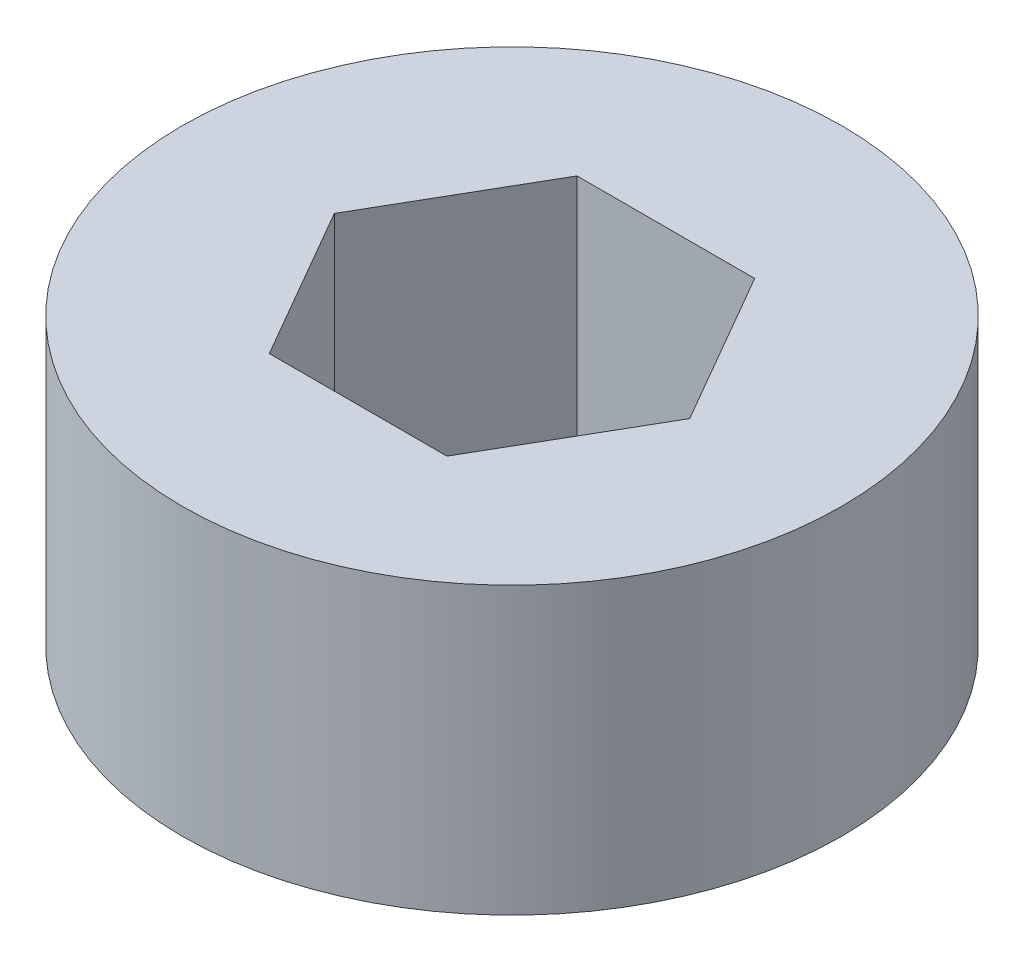
ISO-10303-21;
HEADER;
FILE_DESCRIPTION(('STEP AP214'),'2;1');
FILE_NAME('part.step','',(''),(''),'','','');
FILE_SCHEMA(('AUTOMOTIVE_DESIGN { 1 0 10303 214 1 1 1 1 }'));
ENDSEC;
DATA;
#1=APPLICATION_CONTEXT('core data for automotive mechanical design processes');
#2=APPLICATION_PROTOCOL_DEFINITION('international standard','automotive_design',2000,#1);
#3=PRODUCT_CONTEXT('',#1,'mechanical');
#4=PRODUCT('Part','Part','',(#3));
#5=PRODUCT_RELATED_PRODUCT_CATEGORY('part','',(#4));
#6=PRODUCT_DEFINITION_FORMATION('','',#4);
#7=PRODUCT_DEFINITION_CONTEXT('part definition',#1,'design');
#8=PRODUCT_DEFINITION('design','',#6,#7);
#9=PRODUCT_DEFINITION_SHAPE('','',#8);
#10=(LENGTH_UNIT() NAMED_UNIT(*) SI_UNIT(.MILLI.,.METRE.));
#11=(NAMED_UNIT(*) PLANE_ANGLE_UNIT() SI_UNIT($,.RADIAN.));
#12=(NAMED_UNIT(*) SI_UNIT($,.STERADIAN.) SOLID_ANGLE_UNIT());
#13=UNCERTAINTY_MEASURE_WITH_UNIT(LENGTH_MEASURE(1.E-05),#10,'distance_accuracy_value','');
#14=(GEOMETRIC_REPRESENTATION_CONTEXT(3) GLOBAL_UNCERTAINTY_ASSIGNED_CONTEXT((#13)) GLOBAL_UNIT_ASSIGNED_CONTEXT((#10,
#11,#12)) REPRESENTATION_CONTEXT('',''));
#15=CARTESIAN_POINT('',(0.,0.,0.));
#16=DIRECTION('',(0.,0.,1.));
#17=DIRECTION('',(1.,0.,0.));
#18=AXIS2_PLACEMENT_3D('',#15,#16,#17);
#19=CARTESIAN_POINT('',(0.,13.,0.));
#20=DIRECTION('',(0.,1.,0.));
#21=DIRECTION('',(0.,0.,1.));
#22=AXIS2_PLACEMENT_3D('',#19,#20,#21);
#23=PLANE('',#22);
#24=CARTESIAN_POINT('',(0.,13.,0.));
#25=DIRECTION('',(0.,1.,0.));
#26=DIRECTION('',(0.,0.,1.));
#27=AXIS2_PLACEMENT_3D('',#24,#25,#26);
#28=CIRCLE('',#27,15.);
#29=CARTESIAN_POINT('',(0.,13.,15.));
#30=VERTEX_POINT('',#29);
#31=EDGE_CURVE('E102',#30,#30,#28,.T.);
#32=ORIENTED_EDGE('',*,*,#31,.T.);
#33=EDGE_LOOP('',(#32));
#34=FACE_BOUND('',#33,.T.);
#35=DIRECTION('',(0.5,0.,0.866025403784439));
#36=VECTOR('',#35,1.);
#37=CARTESIAN_POINT('',(6.06217782649107,13.,-3.5));
#38=LINE('',#37,#36);
#39=CARTESIAN_POINT('',(4.04145188432738,13.,-7.));
#40=VERTEX_POINT('',#39);
#41=CARTESIAN_POINT('',(8.08290376865476,13.,0.));
#42=VERTEX_POINT('',#41);
#43=EDGE_CURVE('E161',#40,#42,#38,.T.);
#44=ORIENTED_EDGE('',*,*,#43,.T.);
#45=DIRECTION('',(-0.5,0.,0.866025403784439));
#46=VECTOR('',#45,1.);
#47=CARTESIAN_POINT('',(6.06217782649107,13.,3.5));
#48=LINE('',#47,#46);
#49=CARTESIAN_POINT('',(4.04145188432738,13.,7.));
#50=VERTEX_POINT('',#49);
#51=EDGE_CURVE('E140',#42,#50,#48,.T.);
#52=ORIENTED_EDGE('',*,*,#51,.T.);
#53=DIRECTION('',(-1.,0.,0.));
#54=VECTOR('',#53,1.);
#55=CARTESIAN_POINT('',(0.,13.,7.));
#56=LINE('',#55,#54);
#57=CARTESIAN_POINT('',(-4.04145188432738,13.,7.));
#58=VERTEX_POINT('',#57);
#59=EDGE_CURVE('E142',#50,#58,#56,.T.);
#60=ORIENTED_EDGE('',*,*,#59,.T.);
#61=DIRECTION('',(-0.5,0.,-0.866025403784439));
#62=VECTOR('',#61,1.);
#63=CARTESIAN_POINT('',(-6.06217782649108,13.,3.5));
#64=LINE('',#63,#62);
#65=CARTESIAN_POINT('',(-8.08290376865477,13.,0.));
#66=VERTEX_POINT('',#65);
#67=EDGE_CURVE('E109',#58,#66,#64,.T.);
#68=ORIENTED_EDGE('',*,*,#67,.T.);
#69=DIRECTION('',(0.5,0.,-0.866025403784439));
#70=VECTOR('',#69,1.);
#71=CARTESIAN_POINT('',(-6.06217782649107,13.,-3.5));
#72=LINE('',#71,#70);
#73=CARTESIAN_POINT('',(-4.04145188432738,13.,-7.));
#74=VERTEX_POINT('',#73);
#75=EDGE_CURVE('E153',#66,#74,#72,.T.);
#76=ORIENTED_EDGE('',*,*,#75,.T.);
#77=DIRECTION('',(1.,0.,0.));
#78=VECTOR('',#77,1.);
#79=CARTESIAN_POINT('',(0.,13.,-7.));
#80=LINE('',#79,#78);
#81=EDGE_CURVE('E157',#74,#40,#80,.T.);
#82=ORIENTED_EDGE('',*,*,#81,.T.);
#83=EDGE_LOOP('',(#44,#52,#60,#68,#76,#82));
#84=FACE_BOUND('',#83,.T.);
#85=ADVANCED_FACE('F45',(#34,#84),#23,.T.);
#86=CARTESIAN_POINT('',(0.,0.,0.));
#87=DIRECTION('',(0.,1.,0.));
#88=DIRECTION('',(0.,0.,1.));
#89=AXIS2_PLACEMENT_3D('',#86,#87,#88);
#90=PLANE('',#89);
#91=CARTESIAN_POINT('',(0.,0.,0.));
#92=DIRECTION('',(0.,1.,0.));
#93=DIRECTION('',(0.,0.,1.));
#94=AXIS2_PLACEMENT_3D('',#91,#92,#93);
#95=CIRCLE('',#94,15.);
#96=CARTESIAN_POINT('',(0.,0.,15.));
#97=VERTEX_POINT('',#96);
#98=EDGE_CURVE('E166',#97,#97,#95,.T.);
#99=ORIENTED_EDGE('',*,*,#98,.F.);
#100=EDGE_LOOP('',(#99));
#101=FACE_BOUND('',#100,.T.);
#102=DIRECTION('',(-0.5,0.,0.866025403784439));
#103=VECTOR('',#102,1.);
#104=CARTESIAN_POINT('',(6.06217782649107,0.,3.5));
#105=LINE('',#104,#103);
#106=CARTESIAN_POINT('',(8.08290376865476,0.,0.));
#107=VERTEX_POINT('',#106);
#108=CARTESIAN_POINT('',(4.04145188432738,0.,7.));
#109=VERTEX_POINT('',#108);
#110=EDGE_CURVE('E11',#107,#109,#105,.T.);
#111=ORIENTED_EDGE('',*,*,#110,.F.);
#112=DIRECTION('',(0.5,0.,0.866025403784439));
#113=VECTOR('',#112,1.);
#114=CARTESIAN_POINT('',(6.06217782649107,0.,-3.5));
#115=LINE('',#114,#113);
#116=CARTESIAN_POINT('',(4.04145188432738,0.,-7.));
#117=VERTEX_POINT('',#116);
#118=EDGE_CURVE('E54',#117,#107,#115,.T.);
#119=ORIENTED_EDGE('',*,*,#118,.F.);
#120=DIRECTION('',(1.,0.,0.));
#121=VECTOR('',#120,1.);
#122=CARTESIAN_POINT('',(0.,0.,-7.));
#123=LINE('',#122,#121);
#124=CARTESIAN_POINT('',(-4.04145188432738,0.,-7.));
#125=VERTEX_POINT('',#124);
#126=EDGE_CURVE('E121',#125,#117,#123,.T.);
#127=ORIENTED_EDGE('',*,*,#126,.F.);
#128=DIRECTION('',(0.5,0.,-0.866025403784439));
#129=VECTOR('',#128,1.);
#130=CARTESIAN_POINT('',(-6.06217782649107,0.,-3.5));
#131=LINE('',#130,#129);
#132=CARTESIAN_POINT('',(-8.08290376865477,0.,0.));
#133=VERTEX_POINT('',#132);
#134=EDGE_CURVE('E117',#133,#125,#131,.T.);
#135=ORIENTED_EDGE('',*,*,#134,.F.);
#136=DIRECTION('',(-0.5,0.,-0.866025403784439));
#137=VECTOR('',#136,1.);
#138=CARTESIAN_POINT('',(-6.06217782649108,0.,3.5));
#139=LINE('',#138,#137);
#140=CARTESIAN_POINT('',(-4.04145188432738,0.,7.));
#141=VERTEX_POINT('',#140);
#142=EDGE_CURVE('E101',#141,#133,#139,.T.);
#143=ORIENTED_EDGE('',*,*,#142,.F.);
#144=DIRECTION('',(-1.,0.,0.));
#145=VECTOR('',#144,1.);
#146=CARTESIAN_POINT('',(0.,0.,7.));
#147=LINE('',#146,#145);
#148=EDGE_CURVE('E95',#109,#141,#147,.T.);
#149=ORIENTED_EDGE('',*,*,#148,.F.);
#150=EDGE_LOOP('',(#111,#119,#127,#135,#143,#149));
#151=FACE_BOUND('',#150,.T.);
#152=ADVANCED_FACE('F115',(#101,#151),#90,.F.);
#153=CARTESIAN_POINT('',(0.,13.,0.));
#154=DIRECTION('',(0.,-1.,0.));
#155=DIRECTION('',(0.,0.,-1.));
#156=AXIS2_PLACEMENT_3D('',#153,#154,#155);
#157=CYLINDRICAL_SURFACE('',#156,15.);
#158=ORIENTED_EDGE('',*,*,#31,.F.);
#159=EDGE_LOOP('',(#158));
#160=FACE_BOUND('',#159,.T.);
#161=ORIENTED_EDGE('',*,*,#98,.T.);
#162=EDGE_LOOP('',(#161));
#163=FACE_BOUND('',#162,.T.);
#164=ADVANCED_FACE('F47',(#160,#163),#157,.T.);
#165=CARTESIAN_POINT('',(4.04145188432738,39.,7.));
#166=DIRECTION('',(-0.866025403784439,0.,-0.5));
#167=DIRECTION('',(-0.5,0.,0.866025403784439));
#168=AXIS2_PLACEMENT_3D('',#165,#166,#167);
#169=PLANE('',#168);
#170=DIRECTION('',(0.,-1.,0.));
#171=VECTOR('',#170,1.);
#172=CARTESIAN_POINT('',(8.08290376865476,39.,0.));
#173=LINE('',#172,#171);
#174=EDGE_CURVE('E133',#42,#107,#173,.T.);
#175=ORIENTED_EDGE('',*,*,#174,.T.);
#176=ORIENTED_EDGE('',*,*,#110,.T.);
#177=DIRECTION('',(0.,-1.,0.));
#178=VECTOR('',#177,1.);
#179=CARTESIAN_POINT('',(4.04145188432738,39.,7.));
#180=LINE('',#179,#178);
#181=EDGE_CURVE('E66',#50,#109,#180,.T.);
#182=ORIENTED_EDGE('',*,*,#181,.F.);
#183=ORIENTED_EDGE('',*,*,#51,.F.);
#184=EDGE_LOOP('',(#175,#176,#182,#183));
#185=FACE_BOUND('',#184,.T.);
#186=ADVANCED_FACE('F138',(#185),#169,.T.);
#187=CARTESIAN_POINT('',(8.08290376865476,39.,0.));
#188=DIRECTION('',(-0.866025403784439,0.,0.5));
#189=DIRECTION('',(0.5,0.,0.866025403784439));
#190=AXIS2_PLACEMENT_3D('',#187,#188,#189);
#191=PLANE('',#190);
#192=DIRECTION('',(0.,-1.,0.));
#193=VECTOR('',#192,1.);
#194=CARTESIAN_POINT('',(4.04145188432738,39.,-7.));
#195=LINE('',#194,#193);
#196=EDGE_CURVE('E136',#40,#117,#195,.T.);
#197=ORIENTED_EDGE('',*,*,#196,.T.);
#198=ORIENTED_EDGE('',*,*,#118,.T.);
#199=ORIENTED_EDGE('',*,*,#174,.F.);
#200=ORIENTED_EDGE('',*,*,#43,.F.);
#201=EDGE_LOOP('',(#197,#198,#199,#200));
#202=FACE_BOUND('',#201,.T.);
#203=ADVANCED_FACE('F132',(#202),#191,.T.);
#204=CARTESIAN_POINT('',(4.04145188432738,39.,-7.));
#205=DIRECTION('',(0.,0.,1.));
#206=DIRECTION('',(1.,0.,0.));
#207=AXIS2_PLACEMENT_3D('',#204,#205,#206);
#208=PLANE('',#207);
#209=DIRECTION('',(0.,-1.,0.));
#210=VECTOR('',#209,1.);
#211=CARTESIAN_POINT('',(-4.04145188432738,39.,-7.));
#212=LINE('',#211,#210);
#213=EDGE_CURVE('E147',#74,#125,#212,.T.);
#214=ORIENTED_EDGE('',*,*,#213,.T.);
#215=ORIENTED_EDGE('',*,*,#126,.T.);
#216=ORIENTED_EDGE('',*,*,#196,.F.);
#217=ORIENTED_EDGE('',*,*,#81,.F.);
#218=EDGE_LOOP('',(#214,#215,#216,#217));
#219=FACE_BOUND('',#218,.T.);
#220=ADVANCED_FACE('F187',(#219),#208,.T.);
#221=CARTESIAN_POINT('',(-4.04145188432738,39.,-7.));
#222=DIRECTION('',(0.866025403784439,0.,0.5));
#223=DIRECTION('',(0.5,0.,-0.866025403784439));
#224=AXIS2_PLACEMENT_3D('',#221,#222,#223);
#225=PLANE('',#224);
#226=DIRECTION('',(0.,-1.,0.));
#227=VECTOR('',#226,1.);
#228=CARTESIAN_POINT('',(-8.08290376865477,39.,0.));
#229=LINE('',#228,#227);
#230=EDGE_CURVE('E112',#66,#133,#229,.T.);
#231=ORIENTED_EDGE('',*,*,#230,.T.);
#232=ORIENTED_EDGE('',*,*,#134,.T.);
#233=ORIENTED_EDGE('',*,*,#213,.F.);
#234=ORIENTED_EDGE('',*,*,#75,.F.);
#235=EDGE_LOOP('',(#231,#232,#233,#234));
#236=FACE_BOUND('',#235,.T.);
#237=ADVANCED_FACE('F190',(#236),#225,.T.);
#238=CARTESIAN_POINT('',(-8.08290376865477,39.,0.));
#239=DIRECTION('',(0.866025403784439,0.,-0.5));
#240=DIRECTION('',(-0.5,0.,-0.866025403784439));
#241=AXIS2_PLACEMENT_3D('',#238,#239,#240);
#242=PLANE('',#241);
#243=DIRECTION('',(0.,-1.,0.));
#244=VECTOR('',#243,1.);
#245=CARTESIAN_POINT('',(-4.04145188432738,39.,7.));
#246=LINE('',#245,#244);
#247=EDGE_CURVE('E61',#58,#141,#246,.T.);
#248=ORIENTED_EDGE('',*,*,#247,.T.);
#249=ORIENTED_EDGE('',*,*,#142,.T.);
#250=ORIENTED_EDGE('',*,*,#230,.F.);
#251=ORIENTED_EDGE('',*,*,#67,.F.);
#252=EDGE_LOOP('',(#248,#249,#250,#251));
#253=FACE_BOUND('',#252,.T.);
#254=ADVANCED_FACE('F105',(#253),#242,.T.);
#255=CARTESIAN_POINT('',(-4.04145188432738,39.,7.));
#256=DIRECTION('',(0.,0.,-1.));
#257=DIRECTION('',(-1.,0.,0.));
#258=AXIS2_PLACEMENT_3D('',#255,#256,#257);
#259=PLANE('',#258);
#260=ORIENTED_EDGE('',*,*,#181,.T.);
#261=ORIENTED_EDGE('',*,*,#148,.T.);
#262=ORIENTED_EDGE('',*,*,#247,.F.);
#263=ORIENTED_EDGE('',*,*,#59,.F.);
#264=EDGE_LOOP('',(#260,#261,#262,#263));
#265=FACE_BOUND('',#264,.T.);
#266=ADVANCED_FACE('F96',(#265),#259,.T.);
#267=CLOSED_SHELL('',(#85,#152,#164,#186,#203,#220,#237,#254,#266));
#268=MANIFOLD_SOLID_BREP('B2',#267);
#269=ADVANCED_BREP_SHAPE_REPRESENTATION('',(#18,#268),#14);
#270=SHAPE_DEFINITION_REPRESENTATION(#9,#269);
ENDSEC;
END-ISO-10303-21;
